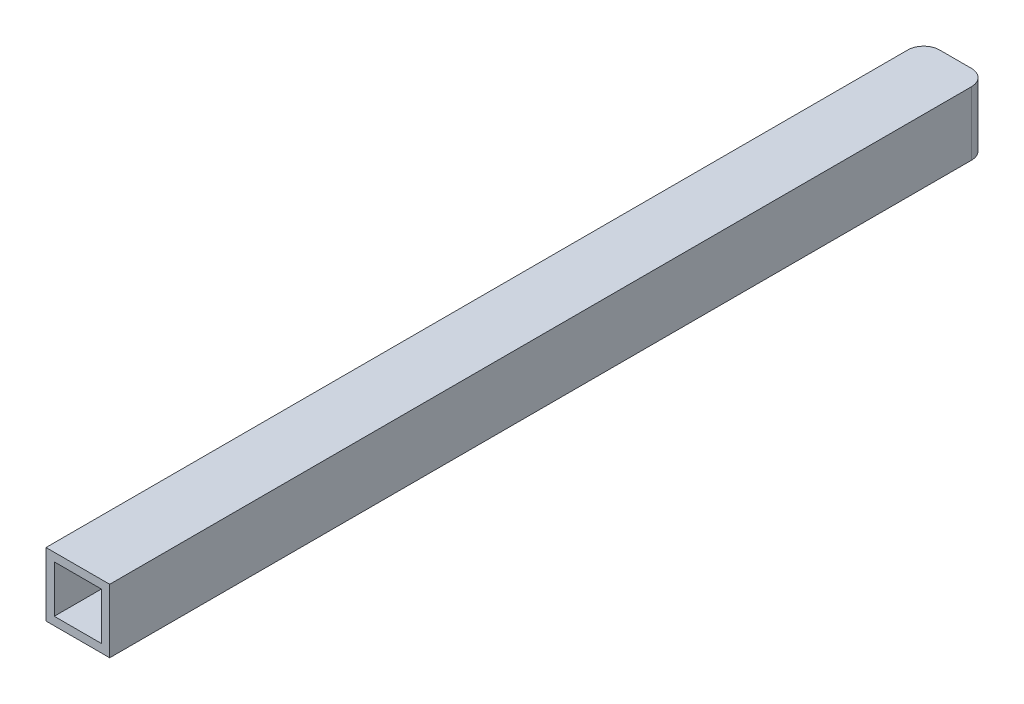
ISO-10303-21;
HEADER;
FILE_DESCRIPTION(('STEP AP214'),'2;1');
FILE_NAME('part.step','',(''),(''),'','','');
FILE_SCHEMA(('AUTOMOTIVE_DESIGN { 1 0 10303 214 1 1 1 1 }'));
ENDSEC;
DATA;
#1=APPLICATION_CONTEXT('core data for automotive mechanical design processes');
#2=APPLICATION_PROTOCOL_DEFINITION('international standard','automotive_design',2000,#1);
#3=PRODUCT_CONTEXT('',#1,'mechanical');
#4=PRODUCT('Part','Part','',(#3));
#5=PRODUCT_RELATED_PRODUCT_CATEGORY('part','',(#4));
#6=PRODUCT_DEFINITION_FORMATION('','',#4);
#7=PRODUCT_DEFINITION_CONTEXT('part definition',#1,'design');
#8=PRODUCT_DEFINITION('design','',#6,#7);
#9=PRODUCT_DEFINITION_SHAPE('','',#8);
#10=(LENGTH_UNIT() NAMED_UNIT(*) SI_UNIT(.MILLI.,.METRE.));
#11=(NAMED_UNIT(*) PLANE_ANGLE_UNIT() SI_UNIT($,.RADIAN.));
#12=(NAMED_UNIT(*) SI_UNIT($,.STERADIAN.) SOLID_ANGLE_UNIT());
#13=UNCERTAINTY_MEASURE_WITH_UNIT(LENGTH_MEASURE(1.E-05),#10,'distance_accuracy_value','');
#14=(GEOMETRIC_REPRESENTATION_CONTEXT(3) GLOBAL_UNCERTAINTY_ASSIGNED_CONTEXT((#13)) GLOBAL_UNIT_ASSIGNED_CONTEXT((#10,
#11,#12)) REPRESENTATION_CONTEXT('',''));
#15=CARTESIAN_POINT('',(0.,0.,0.));
#16=DIRECTION('',(0.,0.,1.));
#17=DIRECTION('',(1.,0.,0.));
#18=AXIS2_PLACEMENT_3D('',#15,#16,#17);
#19=CARTESIAN_POINT('',(0.,0.,0.));
#20=DIRECTION('',(0.,0.,-1.));
#21=DIRECTION('',(-1.,0.,0.));
#22=AXIS2_PLACEMENT_3D('',#19,#20,#21);
#23=PLANE('',#22);
#24=DIRECTION('',(-1.,0.,0.));
#25=VECTOR('',#24,1.);
#26=CARTESIAN_POINT('',(6.35,6.35,0.));
#27=LINE('',#26,#25);
#28=CARTESIAN_POINT('',(3.175,6.35,0.));
#29=VERTEX_POINT('',#28);
#30=CARTESIAN_POINT('',(-3.175,6.35,0.));
#31=VERTEX_POINT('',#30);
#32=EDGE_CURVE('E199',#29,#31,#27,.T.);
#33=ORIENTED_EDGE('',*,*,#32,.F.);
#34=DIRECTION('',(0.,1.,0.));
#35=VECTOR('',#34,1.);
#36=CARTESIAN_POINT('',(3.175,-6.35,0.));
#37=LINE('',#36,#35);
#38=CARTESIAN_POINT('',(3.175,4.7,0.));
#39=VERTEX_POINT('',#38);
#40=EDGE_CURVE('E136',#39,#29,#37,.T.);
#41=ORIENTED_EDGE('',*,*,#40,.F.);
#42=DIRECTION('',(-1.,0.,0.));
#43=VECTOR('',#42,1.);
#44=CARTESIAN_POINT('',(4.7,4.7,0.));
#45=LINE('',#44,#43);
#46=CARTESIAN_POINT('',(-3.175,4.7,0.));
#47=VERTEX_POINT('',#46);
#48=EDGE_CURVE('E59',#39,#47,#45,.T.);
#49=ORIENTED_EDGE('',*,*,#48,.T.);
#50=DIRECTION('',(0.,1.,0.));
#51=VECTOR('',#50,1.);
#52=CARTESIAN_POINT('',(-3.175,-6.35,0.));
#53=LINE('',#52,#51);
#54=EDGE_CURVE('E165',#47,#31,#53,.T.);
#55=ORIENTED_EDGE('',*,*,#54,.T.);
#56=EDGE_LOOP('',(#33,#41,#49,#55));
#57=FACE_BOUND('',#56,.T.);
#58=ADVANCED_FACE('F37',(#57),#23,.T.);
#59=DIRECTION('',(1.,0.,0.));
#60=VECTOR('',#59,1.);
#61=CARTESIAN_POINT('',(4.7,-4.7,0.));
#62=LINE('',#61,#60);
#63=CARTESIAN_POINT('',(-3.175,-4.7,0.));
#64=VERTEX_POINT('',#63);
#65=CARTESIAN_POINT('',(3.175,-4.7,0.));
#66=VERTEX_POINT('',#65);
#67=EDGE_CURVE('E228',#64,#66,#62,.T.);
#68=ORIENTED_EDGE('',*,*,#67,.T.);
#69=CARTESIAN_POINT('',(3.175,-6.35,0.));
#70=VERTEX_POINT('',#69);
#71=EDGE_CURVE('E238',#70,#66,#37,.T.);
#72=ORIENTED_EDGE('',*,*,#71,.F.);
#73=DIRECTION('',(1.,0.,0.));
#74=VECTOR('',#73,1.);
#75=CARTESIAN_POINT('',(6.35,-6.35,0.));
#76=LINE('',#75,#74);
#77=CARTESIAN_POINT('',(-3.175,-6.35,0.));
#78=VERTEX_POINT('',#77);
#79=EDGE_CURVE('E146',#78,#70,#76,.T.);
#80=ORIENTED_EDGE('',*,*,#79,.F.);
#81=EDGE_CURVE('E224',#78,#64,#53,.T.);
#82=ORIENTED_EDGE('',*,*,#81,.T.);
#83=EDGE_LOOP('',(#68,#72,#80,#82));
#84=FACE_BOUND('',#83,.T.);
#85=ADVANCED_FACE('F237',(#84),#23,.T.);
#86=CARTESIAN_POINT('',(6.35,6.35,175.));
#87=DIRECTION('',(-1.,0.,0.));
#88=DIRECTION('',(0.,-1.,0.));
#89=AXIS2_PLACEMENT_3D('',#86,#87,#88);
#90=PLANE('',#89);
#91=DIRECTION('',(0.,1.,0.));
#92=VECTOR('',#91,1.);
#93=CARTESIAN_POINT('',(6.35,-6.35,3.175));
#94=LINE('',#93,#92);
#95=CARTESIAN_POINT('',(6.35,-6.35,3.175));
#96=VERTEX_POINT('',#95);
#97=CARTESIAN_POINT('',(6.35,6.35,3.175));
#98=VERTEX_POINT('',#97);
#99=EDGE_CURVE('E125',#96,#98,#94,.T.);
#100=ORIENTED_EDGE('',*,*,#99,.T.);
#101=DIRECTION('',(0.,0.,-1.));
#102=VECTOR('',#101,1.);
#103=CARTESIAN_POINT('',(6.35,6.35,175.));
#104=LINE('',#103,#102);
#105=CARTESIAN_POINT('',(6.35,6.35,175.));
#106=VERTEX_POINT('',#105);
#107=EDGE_CURVE('E151',#106,#98,#104,.T.);
#108=ORIENTED_EDGE('',*,*,#107,.F.);
#109=DIRECTION('',(0.,1.,0.));
#110=VECTOR('',#109,1.);
#111=CARTESIAN_POINT('',(6.35,6.35,175.));
#112=LINE('',#111,#110);
#113=CARTESIAN_POINT('',(6.35,-6.35,175.));
#114=VERTEX_POINT('',#113);
#115=EDGE_CURVE('E149',#114,#106,#112,.T.);
#116=ORIENTED_EDGE('',*,*,#115,.F.);
#117=DIRECTION('',(0.,0.,-1.));
#118=VECTOR('',#117,1.);
#119=CARTESIAN_POINT('',(6.35,-6.35,175.));
#120=LINE('',#119,#118);
#121=EDGE_CURVE('E142',#114,#96,#120,.T.);
#122=ORIENTED_EDGE('',*,*,#121,.T.);
#123=EDGE_LOOP('',(#100,#108,#116,#122));
#124=FACE_BOUND('',#123,.T.);
#125=ADVANCED_FACE('F148',(#124),#90,.F.);
#126=CARTESIAN_POINT('',(0.,0.,175.));
#127=DIRECTION('',(0.,0.,-1.));
#128=DIRECTION('',(-1.,0.,0.));
#129=AXIS2_PLACEMENT_3D('',#126,#127,#128);
#130=PLANE('',#129);
#131=DIRECTION('',(0.,-1.,0.));
#132=VECTOR('',#131,1.);
#133=CARTESIAN_POINT('',(-6.35,6.35,175.));
#134=LINE('',#133,#132);
#135=CARTESIAN_POINT('',(-6.35,6.35,175.));
#136=VERTEX_POINT('',#135);
#137=CARTESIAN_POINT('',(-6.35,-6.35,175.));
#138=VERTEX_POINT('',#137);
#139=EDGE_CURVE('E195',#136,#138,#134,.T.);
#140=ORIENTED_EDGE('',*,*,#139,.T.);
#141=DIRECTION('',(1.,0.,0.));
#142=VECTOR('',#141,1.);
#143=CARTESIAN_POINT('',(6.35,-6.35,175.));
#144=LINE('',#143,#142);
#145=EDGE_CURVE('E198',#138,#114,#144,.T.);
#146=ORIENTED_EDGE('',*,*,#145,.T.);
#147=ORIENTED_EDGE('',*,*,#115,.T.);
#148=DIRECTION('',(-1.,0.,0.));
#149=VECTOR('',#148,1.);
#150=CARTESIAN_POINT('',(6.35,6.35,175.));
#151=LINE('',#150,#149);
#152=EDGE_CURVE('E202',#106,#136,#151,.T.);
#153=ORIENTED_EDGE('',*,*,#152,.T.);
#154=EDGE_LOOP('',(#140,#146,#147,#153));
#155=FACE_BOUND('',#154,.T.);
#156=DIRECTION('',(0.,-1.,0.));
#157=VECTOR('',#156,1.);
#158=CARTESIAN_POINT('',(-4.7,4.7,175.));
#159=LINE('',#158,#157);
#160=CARTESIAN_POINT('',(-4.7,4.7,175.));
#161=VERTEX_POINT('',#160);
#162=CARTESIAN_POINT('',(-4.7,-4.7,175.));
#163=VERTEX_POINT('',#162);
#164=EDGE_CURVE('E229',#161,#163,#159,.T.);
#165=ORIENTED_EDGE('',*,*,#164,.F.);
#166=DIRECTION('',(-1.,0.,0.));
#167=VECTOR('',#166,1.);
#168=CARTESIAN_POINT('',(4.7,4.7,175.));
#169=LINE('',#168,#167);
#170=CARTESIAN_POINT('',(4.7,4.7,175.));
#171=VERTEX_POINT('',#170);
#172=EDGE_CURVE('E181',#171,#161,#169,.T.);
#173=ORIENTED_EDGE('',*,*,#172,.F.);
#174=DIRECTION('',(0.,1.,0.));
#175=VECTOR('',#174,1.);
#176=CARTESIAN_POINT('',(4.7,4.7,175.));
#177=LINE('',#176,#175);
#178=CARTESIAN_POINT('',(4.7,-4.7,175.));
#179=VERTEX_POINT('',#178);
#180=EDGE_CURVE('E187',#179,#171,#177,.T.);
#181=ORIENTED_EDGE('',*,*,#180,.F.);
#182=DIRECTION('',(1.,0.,0.));
#183=VECTOR('',#182,1.);
#184=CARTESIAN_POINT('',(4.7,-4.7,175.));
#185=LINE('',#184,#183);
#186=EDGE_CURVE('E231',#163,#179,#185,.T.);
#187=ORIENTED_EDGE('',*,*,#186,.F.);
#188=EDGE_LOOP('',(#165,#173,#181,#187));
#189=FACE_BOUND('',#188,.T.);
#190=ADVANCED_FACE('F256',(#155,#189),#130,.F.);
#191=CARTESIAN_POINT('',(-6.35,6.35,175.));
#192=DIRECTION('',(1.,0.,0.));
#193=DIRECTION('',(0.,1.,0.));
#194=AXIS2_PLACEMENT_3D('',#191,#192,#193);
#195=PLANE('',#194);
#196=DIRECTION('',(0.,0.,-1.));
#197=VECTOR('',#196,1.);
#198=CARTESIAN_POINT('',(-6.35,6.35,175.));
#199=LINE('',#198,#197);
#200=CARTESIAN_POINT('',(-6.35,6.35,3.175));
#201=VERTEX_POINT('',#200);
#202=EDGE_CURVE('E155',#136,#201,#199,.T.);
#203=ORIENTED_EDGE('',*,*,#202,.T.);
#204=DIRECTION('',(0.,1.,0.));
#205=VECTOR('',#204,1.);
#206=CARTESIAN_POINT('',(-6.35,-6.35,3.175));
#207=LINE('',#206,#205);
#208=CARTESIAN_POINT('',(-6.35,-6.35,3.175));
#209=VERTEX_POINT('',#208);
#210=EDGE_CURVE('E177',#209,#201,#207,.T.);
#211=ORIENTED_EDGE('',*,*,#210,.F.);
#212=DIRECTION('',(0.,0.,-1.));
#213=VECTOR('',#212,1.);
#214=CARTESIAN_POINT('',(-6.35,-6.35,175.));
#215=LINE('',#214,#213);
#216=EDGE_CURVE('E150',#138,#209,#215,.T.);
#217=ORIENTED_EDGE('',*,*,#216,.F.);
#218=ORIENTED_EDGE('',*,*,#139,.F.);
#219=EDGE_LOOP('',(#203,#211,#217,#218));
#220=FACE_BOUND('',#219,.T.);
#221=ADVANCED_FACE('F39',(#220),#195,.F.);
#222=CARTESIAN_POINT('',(6.35,-6.35,175.));
#223=DIRECTION('',(0.,1.,0.));
#224=DIRECTION('',(-1.,0.,0.));
#225=AXIS2_PLACEMENT_3D('',#222,#223,#224);
#226=PLANE('',#225);
#227=ORIENTED_EDGE('',*,*,#79,.T.);
#228=CARTESIAN_POINT('',(3.175,-6.35,3.175));
#229=DIRECTION('',(0.,-1.,0.));
#230=DIRECTION('',(1.,0.,0.));
#231=AXIS2_PLACEMENT_3D('',#228,#229,#230);
#232=CIRCLE('',#231,3.175);
#233=EDGE_CURVE('E128',#70,#96,#232,.T.);
#234=ORIENTED_EDGE('',*,*,#233,.T.);
#235=ORIENTED_EDGE('',*,*,#121,.F.);
#236=ORIENTED_EDGE('',*,*,#145,.F.);
#237=ORIENTED_EDGE('',*,*,#216,.T.);
#238=CARTESIAN_POINT('',(-3.175,-6.35,3.175));
#239=DIRECTION('',(0.,-1.,0.));
#240=DIRECTION('',(1.,0.,0.));
#241=AXIS2_PLACEMENT_3D('',#238,#239,#240);
#242=CIRCLE('',#241,3.175);
#243=EDGE_CURVE('E217',#209,#78,#242,.T.);
#244=ORIENTED_EDGE('',*,*,#243,.T.);
#245=EDGE_LOOP('',(#227,#234,#235,#236,#237,#244));
#246=FACE_BOUND('',#245,.T.);
#247=ADVANCED_FACE('F141',(#246),#226,.F.);
#248=CARTESIAN_POINT('',(6.35,6.35,175.));
#249=DIRECTION('',(0.,-1.,0.));
#250=DIRECTION('',(1.,0.,0.));
#251=AXIS2_PLACEMENT_3D('',#248,#249,#250);
#252=PLANE('',#251);
#253=ORIENTED_EDGE('',*,*,#107,.T.);
#254=CARTESIAN_POINT('',(3.175,6.35,3.175));
#255=DIRECTION('',(0.,-1.,0.));
#256=DIRECTION('',(1.,0.,0.));
#257=AXIS2_PLACEMENT_3D('',#254,#255,#256);
#258=CIRCLE('',#257,3.175);
#259=EDGE_CURVE('E131',#29,#98,#258,.T.);
#260=ORIENTED_EDGE('',*,*,#259,.F.);
#261=ORIENTED_EDGE('',*,*,#32,.T.);
#262=CARTESIAN_POINT('',(-3.175,6.35,3.175));
#263=DIRECTION('',(0.,-1.,0.));
#264=DIRECTION('',(1.,0.,0.));
#265=AXIS2_PLACEMENT_3D('',#262,#263,#264);
#266=CIRCLE('',#265,3.175);
#267=EDGE_CURVE('E215',#201,#31,#266,.T.);
#268=ORIENTED_EDGE('',*,*,#267,.F.);
#269=ORIENTED_EDGE('',*,*,#202,.F.);
#270=ORIENTED_EDGE('',*,*,#152,.F.);
#271=EDGE_LOOP('',(#253,#260,#261,#268,#269,#270));
#272=FACE_BOUND('',#271,.T.);
#273=ADVANCED_FACE('F214',(#272),#252,.F.);
#274=CARTESIAN_POINT('',(-4.7,4.7,175.));
#275=DIRECTION('',(1.,0.,0.));
#276=DIRECTION('',(0.,1.,0.));
#277=AXIS2_PLACEMENT_3D('',#274,#275,#276);
#278=PLANE('',#277);
#279=DIRECTION('',(0.,1.,0.));
#280=VECTOR('',#279,1.);
#281=CARTESIAN_POINT('',(-4.7,-6.35,0.390219936871136));
#282=LINE('',#281,#280);
#283=CARTESIAN_POINT('',(-4.7,4.7,0.390219936871135));
#284=VERTEX_POINT('',#283);
#285=CARTESIAN_POINT('',(-4.7,-4.7,0.390219936871136));
#286=VERTEX_POINT('',#285);
#287=EDGE_CURVE('E162',#284,#286,#282,.F.);
#288=ORIENTED_EDGE('',*,*,#287,.F.);
#289=DIRECTION('',(0.,0.,-1.));
#290=VECTOR('',#289,1.);
#291=CARTESIAN_POINT('',(-4.7,4.7,175.));
#292=LINE('',#291,#290);
#293=EDGE_CURVE('E172',#161,#284,#292,.T.);
#294=ORIENTED_EDGE('',*,*,#293,.F.);
#295=ORIENTED_EDGE('',*,*,#164,.T.);
#296=DIRECTION('',(0.,0.,-1.));
#297=VECTOR('',#296,1.);
#298=CARTESIAN_POINT('',(-4.7,-4.7,175.));
#299=LINE('',#298,#297);
#300=EDGE_CURVE('E175',#163,#286,#299,.T.);
#301=ORIENTED_EDGE('',*,*,#300,.T.);
#302=EDGE_LOOP('',(#288,#294,#295,#301));
#303=FACE_BOUND('',#302,.T.);
#304=ADVANCED_FACE('F171',(#303),#278,.T.);
#305=CARTESIAN_POINT('',(4.7,-4.7,175.));
#306=DIRECTION('',(0.,1.,0.));
#307=DIRECTION('',(-1.,0.,0.));
#308=AXIS2_PLACEMENT_3D('',#305,#306,#307);
#309=PLANE('',#308);
#310=CARTESIAN_POINT('',(3.175,-4.7,3.175));
#311=DIRECTION('',(0.,1.,0.));
#312=DIRECTION('',(-1.,0.,0.));
#313=AXIS2_PLACEMENT_3D('',#310,#311,#312);
#314=CIRCLE('',#313,3.175);
#315=CARTESIAN_POINT('',(4.7,-4.7,0.390219936871137));
#316=VERTEX_POINT('',#315);
#317=EDGE_CURVE('E218',#66,#316,#314,.F.);
#318=ORIENTED_EDGE('',*,*,#317,.F.);
#319=ORIENTED_EDGE('',*,*,#67,.F.);
#320=CARTESIAN_POINT('',(-3.175,-4.7,3.175));
#321=DIRECTION('',(0.,1.,0.));
#322=DIRECTION('',(-1.,0.,0.));
#323=AXIS2_PLACEMENT_3D('',#320,#321,#322);
#324=CIRCLE('',#323,3.175);
#325=EDGE_CURVE('E176',#286,#64,#324,.F.);
#326=ORIENTED_EDGE('',*,*,#325,.F.);
#327=ORIENTED_EDGE('',*,*,#300,.F.);
#328=ORIENTED_EDGE('',*,*,#186,.T.);
#329=DIRECTION('',(0.,0.,-1.));
#330=VECTOR('',#329,1.);
#331=CARTESIAN_POINT('',(4.7,-4.7,175.));
#332=LINE('',#331,#330);
#333=EDGE_CURVE('E185',#179,#316,#332,.T.);
#334=ORIENTED_EDGE('',*,*,#333,.T.);
#335=EDGE_LOOP('',(#318,#319,#326,#327,#328,#334));
#336=FACE_BOUND('',#335,.T.);
#337=ADVANCED_FACE('F241',(#336),#309,.T.);
#338=CARTESIAN_POINT('',(4.7,4.7,175.));
#339=DIRECTION('',(-1.,0.,0.));
#340=DIRECTION('',(0.,-1.,0.));
#341=AXIS2_PLACEMENT_3D('',#338,#339,#340);
#342=PLANE('',#341);
#343=DIRECTION('',(0.,1.,0.));
#344=VECTOR('',#343,1.);
#345=CARTESIAN_POINT('',(4.7,-6.35,0.390219936871137));
#346=LINE('',#345,#344);
#347=CARTESIAN_POINT('',(4.7,4.7,0.390219936871137));
#348=VERTEX_POINT('',#347);
#349=EDGE_CURVE('E51',#316,#348,#346,.T.);
#350=ORIENTED_EDGE('',*,*,#349,.F.);
#351=ORIENTED_EDGE('',*,*,#333,.F.);
#352=ORIENTED_EDGE('',*,*,#180,.T.);
#353=DIRECTION('',(0.,0.,-1.));
#354=VECTOR('',#353,1.);
#355=CARTESIAN_POINT('',(4.7,4.7,175.));
#356=LINE('',#355,#354);
#357=EDGE_CURVE('E182',#171,#348,#356,.T.);
#358=ORIENTED_EDGE('',*,*,#357,.T.);
#359=EDGE_LOOP('',(#350,#351,#352,#358));
#360=FACE_BOUND('',#359,.T.);
#361=ADVANCED_FACE('F244',(#360),#342,.T.);
#362=CARTESIAN_POINT('',(4.7,4.7,175.));
#363=DIRECTION('',(0.,-1.,0.));
#364=DIRECTION('',(1.,0.,0.));
#365=AXIS2_PLACEMENT_3D('',#362,#363,#364);
#366=PLANE('',#365);
#367=CARTESIAN_POINT('',(3.175,4.7,3.175));
#368=DIRECTION('',(0.,-1.,0.));
#369=DIRECTION('',(1.,0.,0.));
#370=AXIS2_PLACEMENT_3D('',#367,#368,#369);
#371=CIRCLE('',#370,3.175);
#372=EDGE_CURVE('E11',#348,#39,#371,.F.);
#373=ORIENTED_EDGE('',*,*,#372,.F.);
#374=ORIENTED_EDGE('',*,*,#357,.F.);
#375=ORIENTED_EDGE('',*,*,#172,.T.);
#376=ORIENTED_EDGE('',*,*,#293,.T.);
#377=CARTESIAN_POINT('',(-3.175,4.7,3.175));
#378=DIRECTION('',(0.,-1.,0.));
#379=DIRECTION('',(1.,0.,0.));
#380=AXIS2_PLACEMENT_3D('',#377,#378,#379);
#381=CIRCLE('',#380,3.175);
#382=EDGE_CURVE('E45',#47,#284,#381,.F.);
#383=ORIENTED_EDGE('',*,*,#382,.F.);
#384=ORIENTED_EDGE('',*,*,#48,.F.);
#385=EDGE_LOOP('',(#373,#374,#375,#376,#383,#384));
#386=FACE_BOUND('',#385,.T.);
#387=ADVANCED_FACE('F179',(#386),#366,.T.);
#388=CARTESIAN_POINT('',(-3.175,-6.35,3.175));
#389=DIRECTION('',(0.,1.,0.));
#390=DIRECTION('',(-1.,0.,0.));
#391=AXIS2_PLACEMENT_3D('',#388,#389,#390);
#392=CYLINDRICAL_SURFACE('',#391,3.175);
#393=ORIENTED_EDGE('',*,*,#325,.T.);
#394=ORIENTED_EDGE('',*,*,#81,.F.);
#395=ORIENTED_EDGE('',*,*,#243,.F.);
#396=ORIENTED_EDGE('',*,*,#210,.T.);
#397=ORIENTED_EDGE('',*,*,#267,.T.);
#398=ORIENTED_EDGE('',*,*,#54,.F.);
#399=ORIENTED_EDGE('',*,*,#382,.T.);
#400=ORIENTED_EDGE('',*,*,#287,.T.);
#401=EDGE_LOOP('',(#393,#394,#395,#396,#397,#398,#399,#400));
#402=FACE_BOUND('',#401,.T.);
#403=ADVANCED_FACE('F161',(#402),#392,.T.);
#404=CARTESIAN_POINT('',(3.175,-6.35,3.175));
#405=DIRECTION('',(0.,1.,0.));
#406=DIRECTION('',(-1.,0.,0.));
#407=AXIS2_PLACEMENT_3D('',#404,#405,#406);
#408=CYLINDRICAL_SURFACE('',#407,3.175);
#409=ORIENTED_EDGE('',*,*,#317,.T.);
#410=ORIENTED_EDGE('',*,*,#349,.T.);
#411=ORIENTED_EDGE('',*,*,#372,.T.);
#412=ORIENTED_EDGE('',*,*,#40,.T.);
#413=ORIENTED_EDGE('',*,*,#259,.T.);
#414=ORIENTED_EDGE('',*,*,#99,.F.);
#415=ORIENTED_EDGE('',*,*,#233,.F.);
#416=ORIENTED_EDGE('',*,*,#71,.T.);
#417=EDGE_LOOP('',(#409,#410,#411,#412,#413,#414,#415,#416));
#418=FACE_BOUND('',#417,.T.);
#419=ADVANCED_FACE('F127',(#418),#408,.T.);
#420=CLOSED_SHELL('',(#58,#85,#125,#190,#221,#247,#273,#304,#337,#361,#387,#403,#419));
#421=MANIFOLD_SOLID_BREP('B2',#420);
#422=ADVANCED_BREP_SHAPE_REPRESENTATION('',(#18,#421),#14);
#423=SHAPE_DEFINITION_REPRESENTATION(#9,#422);
ENDSEC;
END-ISO-10303-21;
